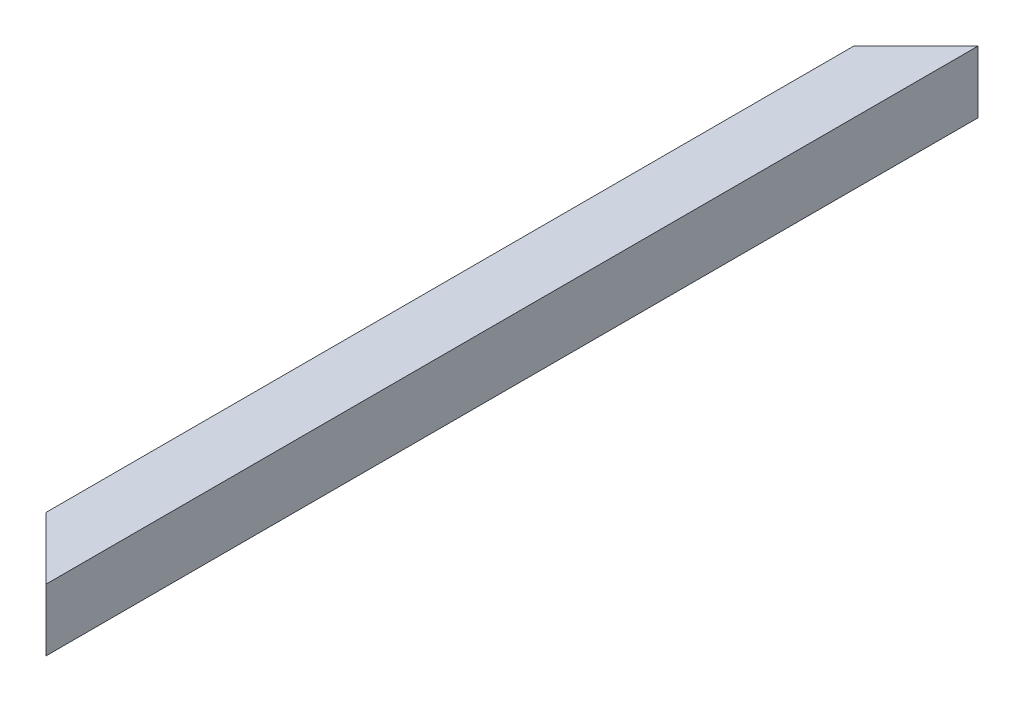
ISO-10303-21;
HEADER;
FILE_DESCRIPTION(('STEP AP214'),'2;1');
FILE_NAME('part.step','',(''),(''),'','','');
FILE_SCHEMA(('AUTOMOTIVE_DESIGN { 1 0 10303 214 1 1 1 1 }'));
ENDSEC;
DATA;
#1=APPLICATION_CONTEXT('core data for automotive mechanical design processes');
#2=APPLICATION_PROTOCOL_DEFINITION('international standard','automotive_design',2000,#1);
#3=PRODUCT_CONTEXT('',#1,'mechanical');
#4=PRODUCT('Part','Part','',(#3));
#5=PRODUCT_RELATED_PRODUCT_CATEGORY('part','',(#4));
#6=PRODUCT_DEFINITION_FORMATION('','',#4);
#7=PRODUCT_DEFINITION_CONTEXT('part definition',#1,'design');
#8=PRODUCT_DEFINITION('design','',#6,#7);
#9=PRODUCT_DEFINITION_SHAPE('','',#8);
#10=(LENGTH_UNIT() NAMED_UNIT(*) SI_UNIT(.MILLI.,.METRE.));
#11=(NAMED_UNIT(*) PLANE_ANGLE_UNIT() SI_UNIT($,.RADIAN.));
#12=(NAMED_UNIT(*) SI_UNIT($,.STERADIAN.) SOLID_ANGLE_UNIT());
#13=UNCERTAINTY_MEASURE_WITH_UNIT(LENGTH_MEASURE(1.E-05),#10,'distance_accuracy_value','');
#14=(GEOMETRIC_REPRESENTATION_CONTEXT(3) GLOBAL_UNCERTAINTY_ASSIGNED_CONTEXT((#13)) GLOBAL_UNIT_ASSIGNED_CONTEXT((#10,
#11,#12)) REPRESENTATION_CONTEXT('',''));
#15=CARTESIAN_POINT('',(0.,0.,0.));
#16=DIRECTION('',(0.,0.,1.));
#17=DIRECTION('',(1.,0.,0.));
#18=AXIS2_PLACEMENT_3D('',#15,#16,#17);
#19=CARTESIAN_POINT('',(-26.,26.,0.));
#20=DIRECTION('',(1.,0.,0.));
#21=DIRECTION('',(0.,0.,-1.));
#22=AXIS2_PLACEMENT_3D('',#19,#20,#21);
#23=PLANE('',#22);
#24=DIRECTION('',(0.,-1.,0.));
#25=VECTOR('',#24,1.);
#26=CARTESIAN_POINT('',(-26.,26.,55.9999999999994));
#27=LINE('',#26,#25);
#28=CARTESIAN_POINT('',(-26.,26.,55.9999999999994));
#29=VERTEX_POINT('',#28);
#30=CARTESIAN_POINT('',(-26.,-26.,55.9999999999994));
#31=VERTEX_POINT('',#30);
#32=EDGE_CURVE('E11',#29,#31,#27,.T.);
#33=ORIENTED_EDGE('',*,*,#32,.F.);
#34=DIRECTION('',(0.,0.,1.));
#35=VECTOR('',#34,1.);
#36=CARTESIAN_POINT('',(-26.,26.,0.));
#37=LINE('',#36,#35);
#38=CARTESIAN_POINT('',(-26.,26.,844.000000000001));
#39=VERTEX_POINT('',#38);
#40=EDGE_CURVE('E145',#29,#39,#37,.T.);
#41=ORIENTED_EDGE('',*,*,#40,.T.);
#42=DIRECTION('',(0.,1.,0.));
#43=VECTOR('',#42,1.);
#44=CARTESIAN_POINT('',(-26.,26.,844.000000000001));
#45=LINE('',#44,#43);
#46=CARTESIAN_POINT('',(-26.,-26.,844.000000000001));
#47=VERTEX_POINT('',#46);
#48=EDGE_CURVE('E43',#47,#39,#45,.T.);
#49=ORIENTED_EDGE('',*,*,#48,.F.);
#50=DIRECTION('',(0.,0.,1.));
#51=VECTOR('',#50,1.);
#52=CARTESIAN_POINT('',(-26.,-26.,0.));
#53=LINE('',#52,#51);
#54=EDGE_CURVE('E132',#31,#47,#53,.T.);
#55=ORIENTED_EDGE('',*,*,#54,.F.);
#56=EDGE_LOOP('',(#33,#41,#49,#55));
#57=FACE_BOUND('',#56,.T.);
#58=ADVANCED_FACE('F35',(#57),#23,.T.);
#59=CARTESIAN_POINT('',(-26.,-26.,0.));
#60=DIRECTION('',(0.,1.,0.));
#61=DIRECTION('',(0.,0.,1.));
#62=AXIS2_PLACEMENT_3D('',#59,#60,#61);
#63=PLANE('',#62);
#64=DIRECTION('',(0.707106781186551,0.,-0.707106781186544));
#65=VECTOR('',#64,1.);
#66=CARTESIAN_POINT('',(1.9999999999997,-26.,28.));
#67=LINE('',#66,#65);
#68=CARTESIAN_POINT('',(26.,-26.,3.99999999999995));
#69=VERTEX_POINT('',#68);
#70=EDGE_CURVE('E165',#31,#69,#67,.T.);
#71=ORIENTED_EDGE('',*,*,#70,.F.);
#72=ORIENTED_EDGE('',*,*,#54,.T.);
#73=DIRECTION('',(-0.707106781186552,0.,-0.707106781186543));
#74=VECTOR('',#73,1.);
#75=CARTESIAN_POINT('',(-448.,-26.,422.000000000005));
#76=LINE('',#75,#74);
#77=CARTESIAN_POINT('',(26.0000000000001,-26.,896.));
#78=VERTEX_POINT('',#77);
#79=EDGE_CURVE('E57',#78,#47,#76,.T.);
#80=ORIENTED_EDGE('',*,*,#79,.F.);
#81=DIRECTION('',(0.,0.,1.));
#82=VECTOR('',#81,1.);
#83=CARTESIAN_POINT('',(26.,-26.,0.));
#84=LINE('',#83,#82);
#85=EDGE_CURVE('E135',#69,#78,#84,.T.);
#86=ORIENTED_EDGE('',*,*,#85,.F.);
#87=EDGE_LOOP('',(#71,#72,#80,#86));
#88=FACE_BOUND('',#87,.T.);
#89=ADVANCED_FACE('F181',(#88),#63,.T.);
#90=CARTESIAN_POINT('',(26.,26.,0.));
#91=DIRECTION('',(-1.,0.,0.));
#92=DIRECTION('',(0.,0.,1.));
#93=AXIS2_PLACEMENT_3D('',#90,#91,#92);
#94=PLANE('',#93);
#95=DIRECTION('',(0.,1.,0.));
#96=VECTOR('',#95,1.);
#97=CARTESIAN_POINT('',(26.,26.,3.99999999999995));
#98=LINE('',#97,#96);
#99=CARTESIAN_POINT('',(26.,26.,3.99999999999995));
#100=VERTEX_POINT('',#99);
#101=EDGE_CURVE('E167',#69,#100,#98,.T.);
#102=ORIENTED_EDGE('',*,*,#101,.F.);
#103=ORIENTED_EDGE('',*,*,#85,.T.);
#104=DIRECTION('',(0.,-1.,0.));
#105=VECTOR('',#104,1.);
#106=CARTESIAN_POINT('',(26.,26.,896.));
#107=LINE('',#106,#105);
#108=CARTESIAN_POINT('',(26.,26.,896.));
#109=VERTEX_POINT('',#108);
#110=EDGE_CURVE('E161',#109,#78,#107,.T.);
#111=ORIENTED_EDGE('',*,*,#110,.F.);
#112=DIRECTION('',(0.,0.,1.));
#113=VECTOR('',#112,1.);
#114=CARTESIAN_POINT('',(26.,26.,0.));
#115=LINE('',#114,#113);
#116=EDGE_CURVE('E141',#100,#109,#115,.T.);
#117=ORIENTED_EDGE('',*,*,#116,.F.);
#118=EDGE_LOOP('',(#102,#103,#111,#117));
#119=FACE_BOUND('',#118,.T.);
#120=ADVANCED_FACE('F178',(#119),#94,.T.);
#121=CARTESIAN_POINT('',(-26.,26.,0.));
#122=DIRECTION('',(0.,-1.,0.));
#123=DIRECTION('',(0.,0.,-1.));
#124=AXIS2_PLACEMENT_3D('',#121,#122,#123);
#125=PLANE('',#124);
#126=DIRECTION('',(-0.707106781186551,0.,0.707106781186544));
#127=VECTOR('',#126,1.);
#128=CARTESIAN_POINT('',(1.9999999999997,26.,28.));
#129=LINE('',#128,#127);
#130=EDGE_CURVE('E49',#100,#29,#129,.T.);
#131=ORIENTED_EDGE('',*,*,#130,.F.);
#132=ORIENTED_EDGE('',*,*,#116,.T.);
#133=DIRECTION('',(0.707106781186552,0.,0.707106781186543));
#134=VECTOR('',#133,1.);
#135=CARTESIAN_POINT('',(-448.,26.,422.000000000005));
#136=LINE('',#135,#134);
#137=EDGE_CURVE('E163',#39,#109,#136,.T.);
#138=ORIENTED_EDGE('',*,*,#137,.F.);
#139=ORIENTED_EDGE('',*,*,#40,.F.);
#140=EDGE_LOOP('',(#131,#132,#138,#139));
#141=FACE_BOUND('',#140,.T.);
#142=ADVANCED_FACE('F173',(#141),#125,.T.);
#143=CARTESIAN_POINT('',(30.,-30.,900.));
#144=DIRECTION('',(0.707106781186543,0.,-0.707106781186552));
#145=DIRECTION('',(-0.707106781186552,0.,-0.707106781186543));
#146=AXIS2_PLACEMENT_3D('',#143,#144,#145);
#147=PLANE('',#146);
#148=ORIENTED_EDGE('',*,*,#137,.T.);
#149=ORIENTED_EDGE('',*,*,#110,.T.);
#150=ORIENTED_EDGE('',*,*,#79,.T.);
#151=ORIENTED_EDGE('',*,*,#48,.T.);
#152=EDGE_LOOP('',(#148,#149,#150,#151));
#153=FACE_BOUND('',#152,.T.);
#154=DIRECTION('',(-0.707106781186552,0.,-0.707106781186543));
#155=VECTOR('',#154,1.);
#156=CARTESIAN_POINT('',(30.,30.,900.));
#157=LINE('',#156,#155);
#158=CARTESIAN_POINT('',(30.,30.,900.));
#159=VERTEX_POINT('',#158);
#160=CARTESIAN_POINT('',(-30.,30.,840.000000000001));
#161=VERTEX_POINT('',#160);
#162=EDGE_CURVE('E154',#159,#161,#157,.T.);
#163=ORIENTED_EDGE('',*,*,#162,.T.);
#164=DIRECTION('',(0.,1.,0.));
#165=VECTOR('',#164,1.);
#166=CARTESIAN_POINT('',(-30.,-30.,840.000000000001));
#167=LINE('',#166,#165);
#168=CARTESIAN_POINT('',(-30.,-30.,840.000000000001));
#169=VERTEX_POINT('',#168);
#170=EDGE_CURVE('E156',#169,#161,#167,.T.);
#171=ORIENTED_EDGE('',*,*,#170,.F.);
#172=DIRECTION('',(-0.707106781186552,0.,-0.707106781186543));
#173=VECTOR('',#172,1.);
#174=CARTESIAN_POINT('',(30.,-30.,900.));
#175=LINE('',#174,#173);
#176=CARTESIAN_POINT('',(30.,-30.,900.));
#177=VERTEX_POINT('',#176);
#178=EDGE_CURVE('E122',#177,#169,#175,.T.);
#179=ORIENTED_EDGE('',*,*,#178,.F.);
#180=DIRECTION('',(0.,1.,0.));
#181=VECTOR('',#180,1.);
#182=CARTESIAN_POINT('',(30.,30.,900.));
#183=LINE('',#182,#181);
#184=EDGE_CURVE('E144',#177,#159,#183,.T.);
#185=ORIENTED_EDGE('',*,*,#184,.T.);
#186=EDGE_LOOP('',(#163,#171,#179,#185));
#187=FACE_BOUND('',#186,.T.);
#188=ADVANCED_FACE('F180',(#153,#187),#147,.F.);
#189=CARTESIAN_POINT('',(30.,-30.,0.));
#190=DIRECTION('',(0.707106781186544,0.,0.707106781186551));
#191=DIRECTION('',(0.707106781186551,0.,-0.707106781186544));
#192=AXIS2_PLACEMENT_3D('',#189,#190,#191);
#193=PLANE('',#192);
#194=ORIENTED_EDGE('',*,*,#130,.T.);
#195=ORIENTED_EDGE('',*,*,#32,.T.);
#196=ORIENTED_EDGE('',*,*,#70,.T.);
#197=ORIENTED_EDGE('',*,*,#101,.T.);
#198=EDGE_LOOP('',(#194,#195,#196,#197));
#199=FACE_BOUND('',#198,.T.);
#200=DIRECTION('',(0.707106781186551,0.,-0.707106781186544));
#201=VECTOR('',#200,1.);
#202=CARTESIAN_POINT('',(30.,30.,0.));
#203=LINE('',#202,#201);
#204=CARTESIAN_POINT('',(-30.,30.,59.9999999999994));
#205=VERTEX_POINT('',#204);
#206=CARTESIAN_POINT('',(30.,30.,0.));
#207=VERTEX_POINT('',#206);
#208=EDGE_CURVE('E109',#205,#207,#203,.T.);
#209=ORIENTED_EDGE('',*,*,#208,.T.);
#210=DIRECTION('',(0.,1.,0.));
#211=VECTOR('',#210,1.);
#212=CARTESIAN_POINT('',(30.,30.,0.));
#213=LINE('',#212,#211);
#214=CARTESIAN_POINT('',(30.,-30.,0.));
#215=VERTEX_POINT('',#214);
#216=EDGE_CURVE('E104',#215,#207,#213,.T.);
#217=ORIENTED_EDGE('',*,*,#216,.F.);
#218=DIRECTION('',(0.707106781186551,0.,-0.707106781186544));
#219=VECTOR('',#218,1.);
#220=CARTESIAN_POINT('',(30.,-30.,0.));
#221=LINE('',#220,#219);
#222=CARTESIAN_POINT('',(-30.,-30.,59.9999999999994));
#223=VERTEX_POINT('',#222);
#224=EDGE_CURVE('E98',#223,#215,#221,.T.);
#225=ORIENTED_EDGE('',*,*,#224,.F.);
#226=DIRECTION('',(0.,1.,0.));
#227=VECTOR('',#226,1.);
#228=CARTESIAN_POINT('',(-30.,-30.,59.9999999999994));
#229=LINE('',#228,#227);
#230=EDGE_CURVE('E101',#223,#205,#229,.T.);
#231=ORIENTED_EDGE('',*,*,#230,.T.);
#232=EDGE_LOOP('',(#209,#217,#225,#231));
#233=FACE_BOUND('',#232,.T.);
#234=ADVANCED_FACE('F100',(#199,#233),#193,.F.);
#235=CARTESIAN_POINT('',(-30.,30.,0.));
#236=DIRECTION('',(-1.,0.,0.));
#237=DIRECTION('',(0.,0.,1.));
#238=AXIS2_PLACEMENT_3D('',#235,#236,#237);
#239=PLANE('',#238);
#240=ORIENTED_EDGE('',*,*,#230,.F.);
#241=DIRECTION('',(0.,0.,1.));
#242=VECTOR('',#241,1.);
#243=CARTESIAN_POINT('',(-30.,-30.,0.));
#244=LINE('',#243,#242);
#245=EDGE_CURVE('E116',#223,#169,#244,.T.);
#246=ORIENTED_EDGE('',*,*,#245,.T.);
#247=ORIENTED_EDGE('',*,*,#170,.T.);
#248=DIRECTION('',(0.,0.,1.));
#249=VECTOR('',#248,1.);
#250=CARTESIAN_POINT('',(-30.,30.,0.));
#251=LINE('',#250,#249);
#252=EDGE_CURVE('E118',#205,#161,#251,.T.);
#253=ORIENTED_EDGE('',*,*,#252,.F.);
#254=EDGE_LOOP('',(#240,#246,#247,#253));
#255=FACE_BOUND('',#254,.T.);
#256=ADVANCED_FACE('F114',(#255),#239,.T.);
#257=CARTESIAN_POINT('',(-30.,-30.,0.));
#258=DIRECTION('',(0.,-1.,0.));
#259=DIRECTION('',(0.,0.,-1.));
#260=AXIS2_PLACEMENT_3D('',#257,#258,#259);
#261=PLANE('',#260);
#262=ORIENTED_EDGE('',*,*,#224,.T.);
#263=DIRECTION('',(0.,0.,1.));
#264=VECTOR('',#263,1.);
#265=CARTESIAN_POINT('',(30.,-30.,0.));
#266=LINE('',#265,#264);
#267=EDGE_CURVE('E123',#215,#177,#266,.T.);
#268=ORIENTED_EDGE('',*,*,#267,.T.);
#269=ORIENTED_EDGE('',*,*,#178,.T.);
#270=ORIENTED_EDGE('',*,*,#245,.F.);
#271=EDGE_LOOP('',(#262,#268,#269,#270));
#272=FACE_BOUND('',#271,.T.);
#273=ADVANCED_FACE('F121',(#272),#261,.T.);
#274=CARTESIAN_POINT('',(30.,30.,0.));
#275=DIRECTION('',(1.,0.,0.));
#276=DIRECTION('',(0.,0.,-1.));
#277=AXIS2_PLACEMENT_3D('',#274,#275,#276);
#278=PLANE('',#277);
#279=DIRECTION('',(0.,0.,1.));
#280=VECTOR('',#279,1.);
#281=CARTESIAN_POINT('',(30.,30.,0.));
#282=LINE('',#281,#280);
#283=EDGE_CURVE('E125',#207,#159,#282,.T.);
#284=ORIENTED_EDGE('',*,*,#283,.T.);
#285=ORIENTED_EDGE('',*,*,#184,.F.);
#286=ORIENTED_EDGE('',*,*,#267,.F.);
#287=ORIENTED_EDGE('',*,*,#216,.T.);
#288=EDGE_LOOP('',(#284,#285,#286,#287));
#289=FACE_BOUND('',#288,.T.);
#290=ADVANCED_FACE('F152',(#289),#278,.T.);
#291=CARTESIAN_POINT('',(-30.,30.,0.));
#292=DIRECTION('',(0.,1.,0.));
#293=DIRECTION('',(0.,0.,1.));
#294=AXIS2_PLACEMENT_3D('',#291,#292,#293);
#295=PLANE('',#294);
#296=ORIENTED_EDGE('',*,*,#208,.F.);
#297=ORIENTED_EDGE('',*,*,#252,.T.);
#298=ORIENTED_EDGE('',*,*,#162,.F.);
#299=ORIENTED_EDGE('',*,*,#283,.F.);
#300=EDGE_LOOP('',(#296,#297,#298,#299));
#301=FACE_BOUND('',#300,.T.);
#302=ADVANCED_FACE('F37',(#301),#295,.T.);
#303=CLOSED_SHELL('',(#58,#89,#120,#142,#188,#234,#256,#273,#290,#302));
#304=MANIFOLD_SOLID_BREP('B2',#303);
#305=ADVANCED_BREP_SHAPE_REPRESENTATION('',(#18,#304),#14);
#306=SHAPE_DEFINITION_REPRESENTATION(#9,#305);
ENDSEC;
END-ISO-10303-21;
